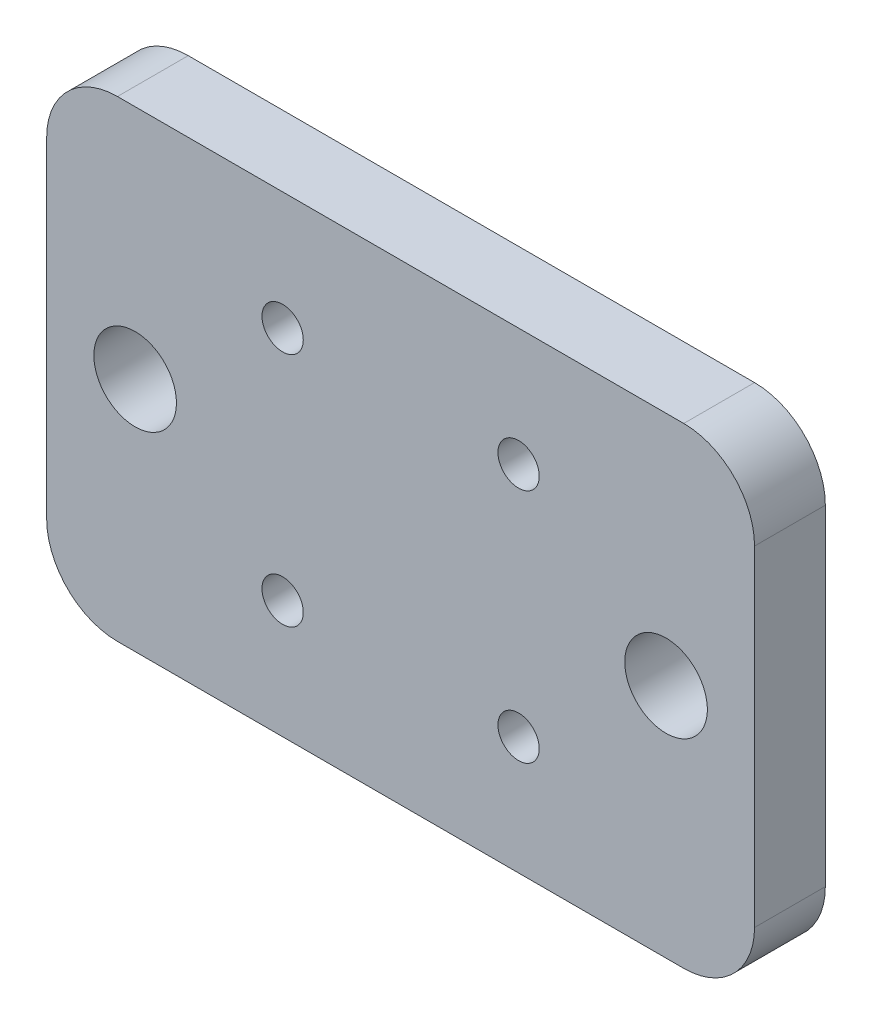
ISO-10303-21;
HEADER;
FILE_DESCRIPTION(('STEP AP214'),'2;1');
FILE_NAME('part.step','',(''),(''),'','','');
FILE_SCHEMA(('AUTOMOTIVE_DESIGN { 1 0 10303 214 1 1 1 1 }'));
ENDSEC;
DATA;
#1=APPLICATION_CONTEXT('core data for automotive mechanical design processes');
#2=APPLICATION_PROTOCOL_DEFINITION('international standard','automotive_design',2000,#1);
#3=PRODUCT_CONTEXT('',#1,'mechanical');
#4=PRODUCT('Part','Part','',(#3));
#5=PRODUCT_RELATED_PRODUCT_CATEGORY('part','',(#4));
#6=PRODUCT_DEFINITION_FORMATION('','',#4);
#7=PRODUCT_DEFINITION_CONTEXT('part definition',#1,'design');
#8=PRODUCT_DEFINITION('design','',#6,#7);
#9=PRODUCT_DEFINITION_SHAPE('','',#8);
#10=(LENGTH_UNIT() NAMED_UNIT(*) SI_UNIT(.MILLI.,.METRE.));
#11=(NAMED_UNIT(*) PLANE_ANGLE_UNIT() SI_UNIT($,.RADIAN.));
#12=(NAMED_UNIT(*) SI_UNIT($,.STERADIAN.) SOLID_ANGLE_UNIT());
#13=UNCERTAINTY_MEASURE_WITH_UNIT(LENGTH_MEASURE(1.E-05),#10,'distance_accuracy_value','');
#14=(GEOMETRIC_REPRESENTATION_CONTEXT(3) GLOBAL_UNCERTAINTY_ASSIGNED_CONTEXT((#13)) GLOBAL_UNIT_ASSIGNED_CONTEXT((#10,
#11,#12)) REPRESENTATION_CONTEXT('',''));
#15=CARTESIAN_POINT('',(0.,0.,0.));
#16=DIRECTION('',(0.,0.,1.));
#17=DIRECTION('',(1.,0.,0.));
#18=AXIS2_PLACEMENT_3D('',#15,#16,#17);
#19=CARTESIAN_POINT('',(0.,0.,6.));
#20=DIRECTION('',(1.,0.,0.));
#21=DIRECTION('',(0.,0.,-1.));
#22=AXIS2_PLACEMENT_3D('',#19,#20,#21);
#23=PLANE('',#22);
#24=DIRECTION('',(0.,-1.,0.));
#25=VECTOR('',#24,1.);
#26=CARTESIAN_POINT('',(0.,0.,0.));
#27=LINE('',#26,#25);
#28=CARTESIAN_POINT('',(0.,34.,0.));
#29=VERTEX_POINT('',#28);
#30=CARTESIAN_POINT('',(0.,6.,0.));
#31=VERTEX_POINT('',#30);
#32=EDGE_CURVE('E157',#29,#31,#27,.T.);
#33=ORIENTED_EDGE('',*,*,#32,.T.);
#34=DIRECTION('',(0.,0.,-1.));
#35=VECTOR('',#34,1.);
#36=CARTESIAN_POINT('',(0.,6.,6.));
#37=LINE('',#36,#35);
#38=CARTESIAN_POINT('',(0.,6.,6.));
#39=VERTEX_POINT('',#38);
#40=EDGE_CURVE('E11',#31,#39,#37,.F.);
#41=ORIENTED_EDGE('',*,*,#40,.T.);
#42=DIRECTION('',(0.,-1.,0.));
#43=VECTOR('',#42,1.);
#44=CARTESIAN_POINT('',(0.,0.,6.));
#45=LINE('',#44,#43);
#46=CARTESIAN_POINT('',(0.,34.,6.));
#47=VERTEX_POINT('',#46);
#48=EDGE_CURVE('E125',#47,#39,#45,.T.);
#49=ORIENTED_EDGE('',*,*,#48,.F.);
#50=DIRECTION('',(0.,0.,-1.));
#51=VECTOR('',#50,1.);
#52=CARTESIAN_POINT('',(0.,34.,6.));
#53=LINE('',#52,#51);
#54=EDGE_CURVE('E41',#47,#29,#53,.T.);
#55=ORIENTED_EDGE('',*,*,#54,.T.);
#56=EDGE_LOOP('',(#33,#41,#49,#55));
#57=FACE_BOUND('',#56,.T.);
#58=ADVANCED_FACE('F33',(#57),#23,.F.);
#59=CARTESIAN_POINT('',(0.,0.,6.));
#60=DIRECTION('',(0.,1.,0.));
#61=DIRECTION('',(0.,0.,1.));
#62=AXIS2_PLACEMENT_3D('',#59,#60,#61);
#63=PLANE('',#62);
#64=DIRECTION('',(1.,0.,0.));
#65=VECTOR('',#64,1.);
#66=CARTESIAN_POINT('',(0.,0.,0.));
#67=LINE('',#66,#65);
#68=CARTESIAN_POINT('',(6.,0.,0.));
#69=VERTEX_POINT('',#68);
#70=CARTESIAN_POINT('',(54.,0.,0.));
#71=VERTEX_POINT('',#70);
#72=EDGE_CURVE('E130',#69,#71,#67,.T.);
#73=ORIENTED_EDGE('',*,*,#72,.T.);
#74=DIRECTION('',(0.,0.,-1.));
#75=VECTOR('',#74,1.);
#76=CARTESIAN_POINT('',(54.,0.,6.));
#77=LINE('',#76,#75);
#78=CARTESIAN_POINT('',(54.,0.,6.));
#79=VERTEX_POINT('',#78);
#80=EDGE_CURVE('E48',#71,#79,#77,.F.);
#81=ORIENTED_EDGE('',*,*,#80,.T.);
#82=DIRECTION('',(1.,0.,0.));
#83=VECTOR('',#82,1.);
#84=CARTESIAN_POINT('',(0.,0.,6.));
#85=LINE('',#84,#83);
#86=CARTESIAN_POINT('',(6.,0.,6.));
#87=VERTEX_POINT('',#86);
#88=EDGE_CURVE('E128',#87,#79,#85,.T.);
#89=ORIENTED_EDGE('',*,*,#88,.F.);
#90=DIRECTION('',(0.,0.,-1.));
#91=VECTOR('',#90,1.);
#92=CARTESIAN_POINT('',(6.,0.,6.));
#93=LINE('',#92,#91);
#94=EDGE_CURVE('E149',#87,#69,#93,.T.);
#95=ORIENTED_EDGE('',*,*,#94,.T.);
#96=EDGE_LOOP('',(#73,#81,#89,#95));
#97=FACE_BOUND('',#96,.T.);
#98=ADVANCED_FACE('F233',(#97),#63,.F.);
#99=CARTESIAN_POINT('',(60.,0.,6.));
#100=DIRECTION('',(-1.,0.,0.));
#101=DIRECTION('',(0.,0.,1.));
#102=AXIS2_PLACEMENT_3D('',#99,#100,#101);
#103=PLANE('',#102);
#104=DIRECTION('',(0.,1.,0.));
#105=VECTOR('',#104,1.);
#106=CARTESIAN_POINT('',(60.,0.,0.));
#107=LINE('',#106,#105);
#108=CARTESIAN_POINT('',(60.,6.,0.));
#109=VERTEX_POINT('',#108);
#110=CARTESIAN_POINT('',(60.,34.,0.));
#111=VERTEX_POINT('',#110);
#112=EDGE_CURVE('E126',#109,#111,#107,.T.);
#113=ORIENTED_EDGE('',*,*,#112,.T.);
#114=DIRECTION('',(0.,0.,-1.));
#115=VECTOR('',#114,1.);
#116=CARTESIAN_POINT('',(60.,34.,6.));
#117=LINE('',#116,#115);
#118=CARTESIAN_POINT('',(60.,34.,6.));
#119=VERTEX_POINT('',#118);
#120=EDGE_CURVE('E104',#111,#119,#117,.F.);
#121=ORIENTED_EDGE('',*,*,#120,.T.);
#122=DIRECTION('',(0.,1.,0.));
#123=VECTOR('',#122,1.);
#124=CARTESIAN_POINT('',(60.,0.,6.));
#125=LINE('',#124,#123);
#126=CARTESIAN_POINT('',(60.,6.,6.));
#127=VERTEX_POINT('',#126);
#128=EDGE_CURVE('E169',#127,#119,#125,.T.);
#129=ORIENTED_EDGE('',*,*,#128,.F.);
#130=DIRECTION('',(0.,0.,-1.));
#131=VECTOR('',#130,1.);
#132=CARTESIAN_POINT('',(60.,6.,6.));
#133=LINE('',#132,#131);
#134=EDGE_CURVE('E109',#127,#109,#133,.T.);
#135=ORIENTED_EDGE('',*,*,#134,.T.);
#136=EDGE_LOOP('',(#113,#121,#129,#135));
#137=FACE_BOUND('',#136,.T.);
#138=ADVANCED_FACE('F230',(#137),#103,.F.);
#139=CARTESIAN_POINT('',(0.,40.,6.));
#140=DIRECTION('',(0.,-1.,0.));
#141=DIRECTION('',(0.,0.,-1.));
#142=AXIS2_PLACEMENT_3D('',#139,#140,#141);
#143=PLANE('',#142);
#144=DIRECTION('',(-1.,0.,0.));
#145=VECTOR('',#144,1.);
#146=CARTESIAN_POINT('',(0.,40.,6.));
#147=LINE('',#146,#145);
#148=CARTESIAN_POINT('',(54.,40.,6.));
#149=VERTEX_POINT('',#148);
#150=CARTESIAN_POINT('',(6.,40.,6.));
#151=VERTEX_POINT('',#150);
#152=EDGE_CURVE('E119',#149,#151,#147,.T.);
#153=ORIENTED_EDGE('',*,*,#152,.F.);
#154=DIRECTION('',(0.,0.,-1.));
#155=VECTOR('',#154,1.);
#156=CARTESIAN_POINT('',(54.,40.,6.));
#157=LINE('',#156,#155);
#158=CARTESIAN_POINT('',(54.,40.,0.));
#159=VERTEX_POINT('',#158);
#160=EDGE_CURVE('E103',#149,#159,#157,.T.);
#161=ORIENTED_EDGE('',*,*,#160,.T.);
#162=DIRECTION('',(-1.,0.,0.));
#163=VECTOR('',#162,1.);
#164=CARTESIAN_POINT('',(0.,40.,0.));
#165=LINE('',#164,#163);
#166=CARTESIAN_POINT('',(6.,40.,0.));
#167=VERTEX_POINT('',#166);
#168=EDGE_CURVE('E116',#159,#167,#165,.T.);
#169=ORIENTED_EDGE('',*,*,#168,.T.);
#170=DIRECTION('',(0.,0.,-1.));
#171=VECTOR('',#170,1.);
#172=CARTESIAN_POINT('',(6.,40.,6.));
#173=LINE('',#172,#171);
#174=EDGE_CURVE('E121',#167,#151,#173,.F.);
#175=ORIENTED_EDGE('',*,*,#174,.T.);
#176=EDGE_LOOP('',(#153,#161,#169,#175));
#177=FACE_BOUND('',#176,.T.);
#178=ADVANCED_FACE('F115',(#177),#143,.F.);
#179=CARTESIAN_POINT('',(0.,0.,6.));
#180=DIRECTION('',(0.,0.,-1.));
#181=DIRECTION('',(-1.,0.,0.));
#182=AXIS2_PLACEMENT_3D('',#179,#180,#181);
#183=PLANE('',#182);
#184=CARTESIAN_POINT('',(52.5,20.,6.));
#185=DIRECTION('',(0.,0.,-1.));
#186=DIRECTION('',(-1.,0.,0.));
#187=AXIS2_PLACEMENT_3D('',#184,#185,#186);
#188=CIRCLE('',#187,3.5);
#189=CARTESIAN_POINT('',(49.,20.,6.));
#190=VERTEX_POINT('',#189);
#191=EDGE_CURVE('E175',#190,#190,#188,.T.);
#192=ORIENTED_EDGE('',*,*,#191,.T.);
#193=EDGE_LOOP('',(#192));
#194=FACE_BOUND('',#193,.T.);
#195=CARTESIAN_POINT('',(7.5,20.,6.));
#196=DIRECTION('',(0.,0.,-1.));
#197=DIRECTION('',(-1.,0.,0.));
#198=AXIS2_PLACEMENT_3D('',#195,#196,#197);
#199=CIRCLE('',#198,3.5);
#200=CARTESIAN_POINT('',(4.,20.,6.));
#201=VERTEX_POINT('',#200);
#202=EDGE_CURVE('E178',#201,#201,#199,.T.);
#203=ORIENTED_EDGE('',*,*,#202,.T.);
#204=EDGE_LOOP('',(#203));
#205=FACE_BOUND('',#204,.T.);
#206=CARTESIAN_POINT('',(20.,10.,6.));
#207=DIRECTION('',(0.,0.,-1.));
#208=DIRECTION('',(-1.,0.,0.));
#209=AXIS2_PLACEMENT_3D('',#206,#207,#208);
#210=CIRCLE('',#209,1.75);
#211=CARTESIAN_POINT('',(18.25,10.,6.));
#212=VERTEX_POINT('',#211);
#213=EDGE_CURVE('E181',#212,#212,#210,.T.);
#214=ORIENTED_EDGE('',*,*,#213,.T.);
#215=EDGE_LOOP('',(#214));
#216=FACE_BOUND('',#215,.T.);
#217=CARTESIAN_POINT('',(40.,10.,6.));
#218=DIRECTION('',(0.,0.,-1.));
#219=DIRECTION('',(-1.,0.,0.));
#220=AXIS2_PLACEMENT_3D('',#217,#218,#219);
#221=CIRCLE('',#220,1.75);
#222=CARTESIAN_POINT('',(38.25,10.,6.));
#223=VERTEX_POINT('',#222);
#224=EDGE_CURVE('E184',#223,#223,#221,.T.);
#225=ORIENTED_EDGE('',*,*,#224,.T.);
#226=EDGE_LOOP('',(#225));
#227=FACE_BOUND('',#226,.T.);
#228=CARTESIAN_POINT('',(40.,30.,6.));
#229=DIRECTION('',(0.,0.,-1.));
#230=DIRECTION('',(-1.,0.,0.));
#231=AXIS2_PLACEMENT_3D('',#228,#229,#230);
#232=CIRCLE('',#231,1.75);
#233=CARTESIAN_POINT('',(38.25,30.,6.));
#234=VERTEX_POINT('',#233);
#235=EDGE_CURVE('E187',#234,#234,#232,.T.);
#236=ORIENTED_EDGE('',*,*,#235,.T.);
#237=EDGE_LOOP('',(#236));
#238=FACE_BOUND('',#237,.T.);
#239=CARTESIAN_POINT('',(20.,30.,6.));
#240=DIRECTION('',(0.,0.,-1.));
#241=DIRECTION('',(-1.,0.,0.));
#242=AXIS2_PLACEMENT_3D('',#239,#240,#241);
#243=CIRCLE('',#242,1.75);
#244=CARTESIAN_POINT('',(18.25,30.,6.));
#245=VERTEX_POINT('',#244);
#246=EDGE_CURVE('E162',#245,#245,#243,.T.);
#247=ORIENTED_EDGE('',*,*,#246,.T.);
#248=EDGE_LOOP('',(#247));
#249=FACE_BOUND('',#248,.T.);
#250=ORIENTED_EDGE('',*,*,#128,.T.);
#251=CARTESIAN_POINT('',(54.,34.,6.));
#252=DIRECTION('',(0.,0.,-1.));
#253=DIRECTION('',(-1.,0.,0.));
#254=AXIS2_PLACEMENT_3D('',#251,#252,#253);
#255=CIRCLE('',#254,6.);
#256=EDGE_CURVE('E147',#119,#149,#255,.F.);
#257=ORIENTED_EDGE('',*,*,#256,.T.);
#258=ORIENTED_EDGE('',*,*,#152,.T.);
#259=CARTESIAN_POINT('',(6.,34.,6.));
#260=DIRECTION('',(0.,0.,-1.));
#261=DIRECTION('',(-1.,0.,0.));
#262=AXIS2_PLACEMENT_3D('',#259,#260,#261);
#263=CIRCLE('',#262,6.);
#264=EDGE_CURVE('E142',#151,#47,#263,.F.);
#265=ORIENTED_EDGE('',*,*,#264,.T.);
#266=ORIENTED_EDGE('',*,*,#48,.T.);
#267=CARTESIAN_POINT('',(6.,6.,6.));
#268=DIRECTION('',(0.,0.,-1.));
#269=DIRECTION('',(-1.,0.,0.));
#270=AXIS2_PLACEMENT_3D('',#267,#268,#269);
#271=CIRCLE('',#270,6.);
#272=EDGE_CURVE('E55',#39,#87,#271,.F.);
#273=ORIENTED_EDGE('',*,*,#272,.T.);
#274=ORIENTED_EDGE('',*,*,#88,.T.);
#275=CARTESIAN_POINT('',(54.,6.,6.));
#276=DIRECTION('',(0.,0.,-1.));
#277=DIRECTION('',(-1.,0.,0.));
#278=AXIS2_PLACEMENT_3D('',#275,#276,#277);
#279=CIRCLE('',#278,6.);
#280=EDGE_CURVE('E145',#79,#127,#279,.F.);
#281=ORIENTED_EDGE('',*,*,#280,.T.);
#282=EDGE_LOOP('',(#250,#257,#258,#265,#266,#273,#274,#281));
#283=FACE_BOUND('',#282,.T.);
#284=ADVANCED_FACE('F216',(#194,#205,#216,#227,#238,#249,#283),#183,.F.);
#285=CARTESIAN_POINT('',(0.,0.,0.));
#286=DIRECTION('',(0.,0.,-1.));
#287=DIRECTION('',(-1.,0.,0.));
#288=AXIS2_PLACEMENT_3D('',#285,#286,#287);
#289=PLANE('',#288);
#290=CARTESIAN_POINT('',(52.5,20.,0.));
#291=DIRECTION('',(0.,0.,1.));
#292=DIRECTION('',(-1.,0.,0.));
#293=AXIS2_PLACEMENT_3D('',#290,#291,#292);
#294=CIRCLE('',#293,3.5);
#295=CARTESIAN_POINT('',(49.,20.,0.));
#296=VERTEX_POINT('',#295);
#297=EDGE_CURVE('E197',#296,#296,#294,.T.);
#298=ORIENTED_EDGE('',*,*,#297,.T.);
#299=EDGE_LOOP('',(#298));
#300=FACE_BOUND('',#299,.T.);
#301=CARTESIAN_POINT('',(7.5,20.,0.));
#302=DIRECTION('',(0.,0.,1.));
#303=DIRECTION('',(1.,0.,0.));
#304=AXIS2_PLACEMENT_3D('',#301,#302,#303);
#305=CIRCLE('',#304,3.5);
#306=CARTESIAN_POINT('',(11.,20.,0.));
#307=VERTEX_POINT('',#306);
#308=EDGE_CURVE('E200',#307,#307,#305,.T.);
#309=ORIENTED_EDGE('',*,*,#308,.T.);
#310=EDGE_LOOP('',(#309));
#311=FACE_BOUND('',#310,.T.);
#312=CARTESIAN_POINT('',(20.,10.,0.));
#313=DIRECTION('',(0.,0.,1.));
#314=DIRECTION('',(-1.,0.,0.));
#315=AXIS2_PLACEMENT_3D('',#312,#313,#314);
#316=CIRCLE('',#315,1.75);
#317=CARTESIAN_POINT('',(18.25,10.,0.));
#318=VERTEX_POINT('',#317);
#319=EDGE_CURVE('E194',#318,#318,#316,.T.);
#320=ORIENTED_EDGE('',*,*,#319,.T.);
#321=EDGE_LOOP('',(#320));
#322=FACE_BOUND('',#321,.T.);
#323=CARTESIAN_POINT('',(40.,10.,0.));
#324=DIRECTION('',(0.,0.,1.));
#325=DIRECTION('',(1.,0.,0.));
#326=AXIS2_PLACEMENT_3D('',#323,#324,#325);
#327=CIRCLE('',#326,1.75);
#328=CARTESIAN_POINT('',(41.75,10.,0.));
#329=VERTEX_POINT('',#328);
#330=EDGE_CURVE('E191',#329,#329,#327,.T.);
#331=ORIENTED_EDGE('',*,*,#330,.T.);
#332=EDGE_LOOP('',(#331));
#333=FACE_BOUND('',#332,.T.);
#334=CARTESIAN_POINT('',(40.,30.,0.));
#335=DIRECTION('',(0.,0.,1.));
#336=DIRECTION('',(-1.,0.,0.));
#337=AXIS2_PLACEMENT_3D('',#334,#335,#336);
#338=CIRCLE('',#337,1.75);
#339=CARTESIAN_POINT('',(38.25,30.,0.));
#340=VERTEX_POINT('',#339);
#341=EDGE_CURVE('E190',#340,#340,#338,.T.);
#342=ORIENTED_EDGE('',*,*,#341,.T.);
#343=EDGE_LOOP('',(#342));
#344=FACE_BOUND('',#343,.T.);
#345=CARTESIAN_POINT('',(20.,30.,0.));
#346=DIRECTION('',(0.,0.,1.));
#347=DIRECTION('',(1.,0.,0.));
#348=AXIS2_PLACEMENT_3D('',#345,#346,#347);
#349=CIRCLE('',#348,1.75);
#350=CARTESIAN_POINT('',(21.75,30.,0.));
#351=VERTEX_POINT('',#350);
#352=EDGE_CURVE('E165',#351,#351,#349,.T.);
#353=ORIENTED_EDGE('',*,*,#352,.T.);
#354=EDGE_LOOP('',(#353));
#355=FACE_BOUND('',#354,.T.);
#356=ORIENTED_EDGE('',*,*,#168,.F.);
#357=CARTESIAN_POINT('',(54.,34.,0.));
#358=DIRECTION('',(0.,0.,-1.));
#359=DIRECTION('',(-1.,0.,0.));
#360=AXIS2_PLACEMENT_3D('',#357,#358,#359);
#361=CIRCLE('',#360,6.);
#362=EDGE_CURVE('E99',#159,#111,#361,.T.);
#363=ORIENTED_EDGE('',*,*,#362,.T.);
#364=ORIENTED_EDGE('',*,*,#112,.F.);
#365=CARTESIAN_POINT('',(54.,6.,0.));
#366=DIRECTION('',(0.,0.,-1.));
#367=DIRECTION('',(-1.,0.,0.));
#368=AXIS2_PLACEMENT_3D('',#365,#366,#367);
#369=CIRCLE('',#368,6.);
#370=EDGE_CURVE('E110',#109,#71,#369,.T.);
#371=ORIENTED_EDGE('',*,*,#370,.T.);
#372=ORIENTED_EDGE('',*,*,#72,.F.);
#373=CARTESIAN_POINT('',(6.,6.,0.));
#374=DIRECTION('',(0.,0.,-1.));
#375=DIRECTION('',(-1.,0.,0.));
#376=AXIS2_PLACEMENT_3D('',#373,#374,#375);
#377=CIRCLE('',#376,6.);
#378=EDGE_CURVE('E136',#69,#31,#377,.T.);
#379=ORIENTED_EDGE('',*,*,#378,.T.);
#380=ORIENTED_EDGE('',*,*,#32,.F.);
#381=CARTESIAN_POINT('',(6.,34.,0.));
#382=DIRECTION('',(0.,0.,-1.));
#383=DIRECTION('',(-1.,0.,0.));
#384=AXIS2_PLACEMENT_3D('',#381,#382,#383);
#385=CIRCLE('',#384,6.);
#386=EDGE_CURVE('E120',#29,#167,#385,.T.);
#387=ORIENTED_EDGE('',*,*,#386,.T.);
#388=EDGE_LOOP('',(#356,#363,#364,#371,#372,#379,#380,#387));
#389=FACE_BOUND('',#388,.T.);
#390=ADVANCED_FACE('F123',(#300,#311,#322,#333,#344,#355,#389),#289,.T.);
#391=CARTESIAN_POINT('',(20.,30.,0.));
#392=DIRECTION('',(0.,0.,1.));
#393=DIRECTION('',(1.,0.,0.));
#394=AXIS2_PLACEMENT_3D('',#391,#392,#393);
#395=CYLINDRICAL_SURFACE('',#394,1.75);
#396=ORIENTED_EDGE('',*,*,#352,.F.);
#397=EDGE_LOOP('',(#396));
#398=FACE_BOUND('',#397,.T.);
#399=ORIENTED_EDGE('',*,*,#246,.F.);
#400=EDGE_LOOP('',(#399));
#401=FACE_BOUND('',#400,.T.);
#402=ADVANCED_FACE('F312',(#398,#401),#395,.F.);
#403=CARTESIAN_POINT('',(40.,30.,0.));
#404=DIRECTION('',(0.,0.,1.));
#405=DIRECTION('',(1.,0.,0.));
#406=AXIS2_PLACEMENT_3D('',#403,#404,#405);
#407=CYLINDRICAL_SURFACE('',#406,1.75);
#408=ORIENTED_EDGE('',*,*,#341,.F.);
#409=EDGE_LOOP('',(#408));
#410=FACE_BOUND('',#409,.T.);
#411=ORIENTED_EDGE('',*,*,#235,.F.);
#412=EDGE_LOOP('',(#411));
#413=FACE_BOUND('',#412,.T.);
#414=ADVANCED_FACE('F303',(#410,#413),#407,.F.);
#415=CARTESIAN_POINT('',(40.,10.,0.));
#416=DIRECTION('',(0.,0.,1.));
#417=DIRECTION('',(1.,0.,0.));
#418=AXIS2_PLACEMENT_3D('',#415,#416,#417);
#419=CYLINDRICAL_SURFACE('',#418,1.75);
#420=ORIENTED_EDGE('',*,*,#330,.F.);
#421=EDGE_LOOP('',(#420));
#422=FACE_BOUND('',#421,.T.);
#423=ORIENTED_EDGE('',*,*,#224,.F.);
#424=EDGE_LOOP('',(#423));
#425=FACE_BOUND('',#424,.T.);
#426=ADVANCED_FACE('F212',(#422,#425),#419,.F.);
#427=CARTESIAN_POINT('',(20.,10.,0.));
#428=DIRECTION('',(0.,0.,1.));
#429=DIRECTION('',(1.,0.,0.));
#430=AXIS2_PLACEMENT_3D('',#427,#428,#429);
#431=CYLINDRICAL_SURFACE('',#430,1.75);
#432=ORIENTED_EDGE('',*,*,#319,.F.);
#433=EDGE_LOOP('',(#432));
#434=FACE_BOUND('',#433,.T.);
#435=ORIENTED_EDGE('',*,*,#213,.F.);
#436=EDGE_LOOP('',(#435));
#437=FACE_BOUND('',#436,.T.);
#438=ADVANCED_FACE('F208',(#434,#437),#431,.F.);
#439=CARTESIAN_POINT('',(7.5,20.,0.));
#440=DIRECTION('',(0.,0.,1.));
#441=DIRECTION('',(1.,0.,0.));
#442=AXIS2_PLACEMENT_3D('',#439,#440,#441);
#443=CYLINDRICAL_SURFACE('',#442,3.5);
#444=ORIENTED_EDGE('',*,*,#308,.F.);
#445=EDGE_LOOP('',(#444));
#446=FACE_BOUND('',#445,.T.);
#447=ORIENTED_EDGE('',*,*,#202,.F.);
#448=EDGE_LOOP('',(#447));
#449=FACE_BOUND('',#448,.T.);
#450=ADVANCED_FACE('F211',(#446,#449),#443,.F.);
#451=CARTESIAN_POINT('',(52.5,20.,0.));
#452=DIRECTION('',(0.,0.,1.));
#453=DIRECTION('',(1.,0.,0.));
#454=AXIS2_PLACEMENT_3D('',#451,#452,#453);
#455=CYLINDRICAL_SURFACE('',#454,3.5);
#456=ORIENTED_EDGE('',*,*,#297,.F.);
#457=EDGE_LOOP('',(#456));
#458=FACE_BOUND('',#457,.T.);
#459=ORIENTED_EDGE('',*,*,#191,.F.);
#460=EDGE_LOOP('',(#459));
#461=FACE_BOUND('',#460,.T.);
#462=ADVANCED_FACE('F251',(#458,#461),#455,.F.);
#463=CARTESIAN_POINT('',(54.,34.,6.));
#464=DIRECTION('',(0.,0.,-1.));
#465=DIRECTION('',(-1.,0.,0.));
#466=AXIS2_PLACEMENT_3D('',#463,#464,#465);
#467=CYLINDRICAL_SURFACE('',#466,6.);
#468=ORIENTED_EDGE('',*,*,#256,.F.);
#469=ORIENTED_EDGE('',*,*,#120,.F.);
#470=ORIENTED_EDGE('',*,*,#362,.F.);
#471=ORIENTED_EDGE('',*,*,#160,.F.);
#472=EDGE_LOOP('',(#468,#469,#470,#471));
#473=FACE_BOUND('',#472,.T.);
#474=ADVANCED_FACE('F102',(#473),#467,.T.);
#475=CARTESIAN_POINT('',(54.,6.,6.));
#476=DIRECTION('',(0.,0.,-1.));
#477=DIRECTION('',(-1.,0.,0.));
#478=AXIS2_PLACEMENT_3D('',#475,#476,#477);
#479=CYLINDRICAL_SURFACE('',#478,6.);
#480=ORIENTED_EDGE('',*,*,#280,.F.);
#481=ORIENTED_EDGE('',*,*,#80,.F.);
#482=ORIENTED_EDGE('',*,*,#370,.F.);
#483=ORIENTED_EDGE('',*,*,#134,.F.);
#484=EDGE_LOOP('',(#480,#481,#482,#483));
#485=FACE_BOUND('',#484,.T.);
#486=ADVANCED_FACE('F232',(#485),#479,.T.);
#487=CARTESIAN_POINT('',(6.,6.,6.));
#488=DIRECTION('',(0.,0.,-1.));
#489=DIRECTION('',(-1.,0.,0.));
#490=AXIS2_PLACEMENT_3D('',#487,#488,#489);
#491=CYLINDRICAL_SURFACE('',#490,6.);
#492=ORIENTED_EDGE('',*,*,#272,.F.);
#493=ORIENTED_EDGE('',*,*,#40,.F.);
#494=ORIENTED_EDGE('',*,*,#378,.F.);
#495=ORIENTED_EDGE('',*,*,#94,.F.);
#496=EDGE_LOOP('',(#492,#493,#494,#495));
#497=FACE_BOUND('',#496,.T.);
#498=ADVANCED_FACE('F236',(#497),#491,.T.);
#499=CARTESIAN_POINT('',(6.,34.,6.));
#500=DIRECTION('',(0.,0.,-1.));
#501=DIRECTION('',(-1.,0.,0.));
#502=AXIS2_PLACEMENT_3D('',#499,#500,#501);
#503=CYLINDRICAL_SURFACE('',#502,6.);
#504=ORIENTED_EDGE('',*,*,#264,.F.);
#505=ORIENTED_EDGE('',*,*,#174,.F.);
#506=ORIENTED_EDGE('',*,*,#386,.F.);
#507=ORIENTED_EDGE('',*,*,#54,.F.);
#508=EDGE_LOOP('',(#504,#505,#506,#507));
#509=FACE_BOUND('',#508,.T.);
#510=ADVANCED_FACE('F35',(#509),#503,.T.);
#511=CLOSED_SHELL('',(#58,#98,#138,#178,#284,#390,#402,#414,#426,#438,#450,#462,#474,#486,#498,#510));
#512=MANIFOLD_SOLID_BREP('B2',#511);
#513=ADVANCED_BREP_SHAPE_REPRESENTATION('',(#18,#512),#14);
#514=SHAPE_DEFINITION_REPRESENTATION(#9,#513);
ENDSEC;
END-ISO-10303-21;
